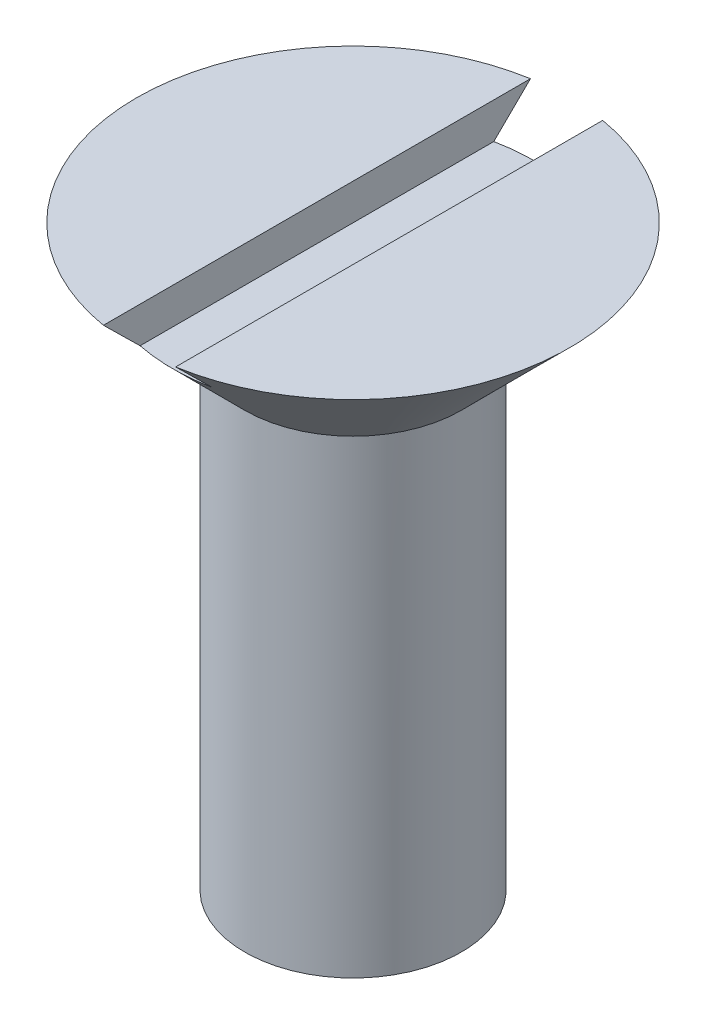
ISO-10303-21;
HEADER;
FILE_DESCRIPTION(('STEP AP214'),'2;1');
FILE_NAME('part.step','',(''),(''),'','','');
FILE_SCHEMA(('AUTOMOTIVE_DESIGN { 1 0 10303 214 1 1 1 1 }'));
ENDSEC;
DATA;
#1=APPLICATION_CONTEXT('core data for automotive mechanical design processes');
#2=APPLICATION_PROTOCOL_DEFINITION('international standard','automotive_design',2000,#1);
#3=PRODUCT_CONTEXT('',#1,'mechanical');
#4=PRODUCT('Part','Part','',(#3));
#5=PRODUCT_RELATED_PRODUCT_CATEGORY('part','',(#4));
#6=PRODUCT_DEFINITION_FORMATION('','',#4);
#7=PRODUCT_DEFINITION_CONTEXT('part definition',#1,'design');
#8=PRODUCT_DEFINITION('design','',#6,#7);
#9=PRODUCT_DEFINITION_SHAPE('','',#8);
#10=(LENGTH_UNIT() NAMED_UNIT(*) SI_UNIT(.MILLI.,.METRE.));
#11=(NAMED_UNIT(*) PLANE_ANGLE_UNIT() SI_UNIT($,.RADIAN.));
#12=(NAMED_UNIT(*) SI_UNIT($,.STERADIAN.) SOLID_ANGLE_UNIT());
#13=UNCERTAINTY_MEASURE_WITH_UNIT(LENGTH_MEASURE(1.E-05),#10,'distance_accuracy_value','');
#14=(GEOMETRIC_REPRESENTATION_CONTEXT(3) GLOBAL_UNCERTAINTY_ASSIGNED_CONTEXT((#13)) GLOBAL_UNIT_ASSIGNED_CONTEXT((#10,
#11,#12)) REPRESENTATION_CONTEXT('',''));
#15=CARTESIAN_POINT('',(0.,0.,0.));
#16=DIRECTION('',(0.,0.,1.));
#17=DIRECTION('',(1.,0.,0.));
#18=AXIS2_PLACEMENT_3D('',#15,#16,#17);
#19=CARTESIAN_POINT('',(0.,9.5,0.));
#20=DIRECTION('',(0.,-1.,0.));
#21=DIRECTION('',(1.,0.,0.));
#22=AXIS2_PLACEMENT_3D('',#19,#20,#21);
#23=PLANE('',#22);
#24=CARTESIAN_POINT('',(0.,9.49999999999999,0.));
#25=DIRECTION('',(0.,-1.,0.));
#26=DIRECTION('',(1.,0.,0.));
#27=AXIS2_PLACEMENT_3D('',#24,#25,#26);
#28=CIRCLE('',#27,5.99999999999999);
#29=CARTESIAN_POINT('',(1.,9.49999999999999,-5.9160797830996));
#30=VERTEX_POINT('',#29);
#31=CARTESIAN_POINT('',(1.,9.49999999999999,5.9160797830996));
#32=VERTEX_POINT('',#31);
#33=EDGE_CURVE('E92',#30,#32,#28,.T.);
#34=ORIENTED_EDGE('',*,*,#33,.F.);
#35=DIRECTION('',(0.,0.,1.));
#36=VECTOR('',#35,1.);
#37=CARTESIAN_POINT('',(1.,9.5,0.));
#38=LINE('',#37,#36);
#39=EDGE_CURVE('E79',#30,#32,#38,.T.);
#40=ORIENTED_EDGE('',*,*,#39,.T.);
#41=EDGE_LOOP('',(#34,#40));
#42=FACE_BOUND('',#41,.T.);
#43=ADVANCED_FACE('F33',(#42),#23,.F.);
#44=CARTESIAN_POINT('',(0.,6.5,0.));
#45=DIRECTION('',(0.,-1.,0.));
#46=DIRECTION('',(0.,0.,-1.));
#47=AXIS2_PLACEMENT_3D('',#44,#45,#46);
#48=CYLINDRICAL_SURFACE('',#47,3.);
#49=CARTESIAN_POINT('',(0.,6.5,0.));
#50=DIRECTION('',(0.,1.,0.));
#51=DIRECTION('',(0.,0.,1.));
#52=AXIS2_PLACEMENT_3D('',#49,#50,#51);
#53=CIRCLE('',#52,3.);
#54=CARTESIAN_POINT('',(0.,6.5,3.));
#55=VERTEX_POINT('',#54);
#56=EDGE_CURVE('E80',#55,#55,#53,.T.);
#57=ORIENTED_EDGE('',*,*,#56,.F.);
#58=EDGE_LOOP('',(#57));
#59=FACE_BOUND('',#58,.T.);
#60=CARTESIAN_POINT('',(0.,-6.5,0.));
#61=DIRECTION('',(0.,1.,0.));
#62=DIRECTION('',(-1.,0.,0.));
#63=AXIS2_PLACEMENT_3D('',#60,#61,#62);
#64=CIRCLE('',#63,3.);
#65=CARTESIAN_POINT('',(-3.,-6.5,0.));
#66=VERTEX_POINT('',#65);
#67=EDGE_CURVE('E91',#66,#66,#64,.T.);
#68=ORIENTED_EDGE('',*,*,#67,.T.);
#69=EDGE_LOOP('',(#68));
#70=FACE_BOUND('',#69,.T.);
#71=ADVANCED_FACE('F35',(#59,#70),#48,.T.);
#72=CARTESIAN_POINT('',(0.,-6.5,0.));
#73=DIRECTION('',(0.,1.,0.));
#74=DIRECTION('',(-1.,0.,0.));
#75=AXIS2_PLACEMENT_3D('',#72,#73,#74);
#76=CONICAL_SURFACE('',#75,3.,1.0471975511966);
#77=CARTESIAN_POINT('',(0.,-8.23205080756887,0.));
#78=VERTEX_POINT('',#77);
#79=VERTEX_LOOP('',#78);
#80=FACE_BOUND('',#79,.T.);
#81=ORIENTED_EDGE('',*,*,#67,.F.);
#82=EDGE_LOOP('',(#81));
#83=FACE_BOUND('',#82,.T.);
#84=ADVANCED_FACE('F136',(#80,#83),#76,.T.);
#85=CARTESIAN_POINT('',(0.,6.5,0.));
#86=DIRECTION('',(0.,1.,0.));
#87=DIRECTION('',(-1.,0.,0.));
#88=AXIS2_PLACEMENT_3D('',#85,#86,#87);
#89=CONICAL_SURFACE('',#88,3.,0.785398163397447);
#90=CARTESIAN_POINT('',(1.,16.7251567472754,-13.1872958179455));
#91=CARTESIAN_POINT('',(1.,16.2594414791178,-12.7202317663481));
#92=CARTESIAN_POINT('',(1.,15.7937860736166,-12.2531079656352));
#93=CARTESIAN_POINT('',(1.,14.8626599021035,-11.31864284358));
#94=CARTESIAN_POINT('',(1.,14.3971891433497,-10.851301515006));
#95=CARTESIAN_POINT('',(1.,13.4661229100358,-9.91592723198499));
#96=CARTESIAN_POINT('',(1.,13.0005276837378,-9.4478940303595));
#97=CARTESIAN_POINT('',(1.,12.0697931653922,-8.51140705834582));
#98=CARTESIAN_POINT('',(1.,11.6046538579373,-8.04295330327226));
#99=CARTESIAN_POINT('',(1.,10.6952303527664,-7.12564772780804));
#100=CARTESIAN_POINT('',(1.,10.2509157767302,-6.67682605040353));
#101=CARTESIAN_POINT('',(1.,9.58531249498371,-6.00268842358769));
#102=CARTESIAN_POINT('',(1.,9.3635777184798,-5.77781303550284));
#103=CARTESIAN_POINT('',(1.,8.92053573168434,-5.32764581841484));
#104=CARTESIAN_POINT('',(1.,8.69922851710114,-5.10235399363653));
#105=CARTESIAN_POINT('',(1.,8.25735053882471,-4.65128463421277));
#106=CARTESIAN_POINT('',(1.,8.03677944454956,-4.42550742379621));
#107=CARTESIAN_POINT('',(1.,7.59659022953599,-3.97300863145959));
#108=CARTESIAN_POINT('',(1.,7.37697214625638,-3.74628701309319));
#109=CARTESIAN_POINT('',(1.,6.93934912614002,-3.29136578605343));
#110=CARTESIAN_POINT('',(1.,6.7213438980336,-3.06316645892879));
#111=CARTESIAN_POINT('',(1.,6.3965872232529,-2.71875619816569));
#112=CARTESIAN_POINT('',(1.,6.28871351212862,-2.60360451292126));
#113=CARTESIAN_POINT('',(1.,6.07406788068338,-2.37227975690297));
#114=CARTESIAN_POINT('',(1.,5.96729593349165,-2.25610671116752));
#115=CARTESIAN_POINT('',(1.,5.8319548726192,-2.10670320150506));
#116=CARTESIAN_POINT('',(1.,5.80260827310486,-2.07417687156442));
#117=CARTESIAN_POINT('',(1.,5.74406556246667,-2.00898893052486));
#118=CARTESIAN_POINT('',(1.,5.71486945173175,-1.97632731907668));
#119=CARTESIAN_POINT('',(1.,5.62753158885472,-1.8781082916074));
#120=CARTESIAN_POINT('',(1.,5.56964574441201,-1.81232267136973));
#121=CARTESIAN_POINT('',(1.,5.4543788094703,-1.67949257125665));
#122=CARTESIAN_POINT('',(1.,5.39700416270754,-1.61244248408974));
#123=CARTESIAN_POINT('',(1.,5.28354317670074,-1.47728707035569));
#124=CARTESIAN_POINT('',(1.,5.22745650755542,-1.40918202166123));
#125=CARTESIAN_POINT('',(1.,5.11665514909253,-1.27094539813078));
#126=CARTESIAN_POINT('',(1.,5.06195522539418,-1.20080188785515));
#127=CARTESIAN_POINT('',(1.,4.9553572846224,-1.05844019622553));
#128=CARTESIAN_POINT('',(1.,4.90345837720404,-0.986222685440405));
#129=CARTESIAN_POINT('',(1.,4.80431328732326,-0.839161434732668));
#130=CARTESIAN_POINT('',(1.,4.75704257118705,-0.764334755914034));
#131=CARTESIAN_POINT('',(1.,4.69173119757185,-0.649006298438077));
#132=CARTESIAN_POINT('',(1.,4.67091066167954,-0.610087935057894));
#133=CARTESIAN_POINT('',(1.,4.63173292035239,-0.531037589401599));
#134=CARTESIAN_POINT('',(1.,4.61337431365398,-0.490906313559382));
#135=CARTESIAN_POINT('',(1.,4.58406393138009,-0.419490460771248));
#136=CARTESIAN_POINT('',(1.,4.57240699225112,-0.388496896961814));
#137=CARTESIAN_POINT('',(1.,4.55130538771347,-0.325753950605731));
#138=CARTESIAN_POINT('',(1.,4.54186081249004,-0.294004537305585));
#139=CARTESIAN_POINT('',(1.,4.52563562662322,-0.229962591669435));
#140=CARTESIAN_POINT('',(1.,4.51884411285098,-0.197672863306547));
#141=CARTESIAN_POINT('',(1.,4.508244068986,-0.132609587949217));
#142=CARTESIAN_POINT('',(1.,4.50443459648098,-0.0998361971449427));
#143=CARTESIAN_POINT('',(1.,4.50002125760406,-0.0337427660645101));
#144=CARTESIAN_POINT('',(1.,4.49944944402216,-0.00042052434033327));
#145=CARTESIAN_POINT('',(1.,4.50162894274971,0.066106977349594));
#146=CARTESIAN_POINT('',(1.,4.50438029208378,0.099312236007858));
#147=CARTESIAN_POINT('',(1.,4.51740606266353,0.198470520840597));
#148=CARTESIAN_POINT('',(1.,4.53246076156448,0.263822080253935));
#149=CARTESIAN_POINT('',(1.,4.56722440758747,0.375614330814849));
#150=CARTESIAN_POINT('',(1.,4.58487561562012,0.42275036495117));
#151=CARTESIAN_POINT('',(1.,4.62420074996022,0.51534258450047));
#152=CARTESIAN_POINT('',(1.,4.64587777118344,0.560797445023055));
#153=CARTESIAN_POINT('',(1.,4.69226708756991,0.65036787810982));
#154=CARTESIAN_POINT('',(1.,4.71699294492147,0.694476291774264));
#155=CARTESIAN_POINT('',(1.,4.768595456994,0.781379292681507));
#156=CARTESIAN_POINT('',(1.,4.79547120785551,0.82417442169449));
#157=CARTESIAN_POINT('',(1.,4.85614214091634,0.916828749418459));
#158=CARTESIAN_POINT('',(1.,4.89027471943994,0.966465584621188));
#159=CARTESIAN_POINT('',(1.,4.96018403830443,1.06457235885529));
#160=CARTESIAN_POINT('',(1.,4.99596110127485,1.11304206604225));
#161=CARTESIAN_POINT('',(1.,5.10513645907693,1.25715407688577));
#162=CARTESIAN_POINT('',(1.,5.18033188621512,1.35143029247925));
#163=CARTESIAN_POINT('',(1.,5.33367557538501,1.53790323878271));
#164=CARTESIAN_POINT('',(1.,5.41183065981283,1.63009427016475));
#165=CARTESIAN_POINT('',(1.,5.56989511079393,1.81288991740956));
#166=CARTESIAN_POINT('',(1.,5.64980374241727,1.90349517031247));
#167=CARTESIAN_POINT('',(1.,5.81098008322576,2.08380872041369));
#168=CARTESIAN_POINT('',(1.,5.89225018058457,2.17351487379724));
#169=CARTESIAN_POINT('',(1.,6.0556490990248,2.35215715158166));
#170=CARTESIAN_POINT('',(1.,6.1377780065437,2.44109319679344));
#171=CARTESIAN_POINT('',(1.,6.30252915009411,2.61824885183037));
#172=CARTESIAN_POINT('',(1.,6.38515042164193,2.70646935993894));
#173=CARTESIAN_POINT('',(1.,6.5508582679686,2.88246606317083));
#174=CARTESIAN_POINT('',(1.,6.63394482640426,2.97024227369646));
#175=CARTESIAN_POINT('',(1.,6.88218482628387,3.23142566754773));
#176=CARTESIAN_POINT('',(1.,7.04786039263831,3.40433638356982));
#177=CARTESIAN_POINT('',(1.,7.38009847617214,3.74930415511372));
#178=CARTESIAN_POINT('',(1.,7.54666100004192,3.92136120417731));
#179=CARTESIAN_POINT('',(1.,8.04724174917981,4.43668523196465));
#180=CARTESIAN_POINT('',(1.,8.38214272283872,4.77909420671125));
#181=CARTESIAN_POINT('',(1.,9.05334774862619,5.46294959353449));
#182=CARTESIAN_POINT('',(1.,9.38965254422716,5.80439527396645));
#183=CARTESIAN_POINT('',(1.,10.0629741512818,6.48657342741749));
#184=CARTESIAN_POINT('',(1.,10.3999909516379,6.82730591139039));
#185=CARTESIAN_POINT('',(1.,11.073661541335,7.50749846773098));
#186=CARTESIAN_POINT('',(1.,11.4103142367272,7.84695962424601));
#187=CARTESIAN_POINT('',(1.,12.0839276750187,8.52557885465702));
#188=CARTESIAN_POINT('',(1.,12.4208884191608,8.86473692731926));
#189=CARTESIAN_POINT('',(1.,13.4319813644562,9.88178552936563));
#190=CARTESIAN_POINT('',(1.,14.1064321918008,10.5593592642572));
#191=CARTESIAN_POINT('',(1.,14.9430035720262,11.3992334393841));
#192=CARTESIAN_POINT('',(1.,15.1049073655753,11.5617499364057));
#193=CARTESIAN_POINT('',(1.,15.4287437938772,11.8867625301678));
#194=CARTESIAN_POINT('',(1.,15.5906764292649,12.0492586262759));
#195=CARTESIAN_POINT('',(1.,15.9146913666169,12.3743580356593));
#196=CARTESIAN_POINT('',(1.,16.0767736855866,12.5369613319847));
#197=CARTESIAN_POINT('',(1.,16.4009534139574,12.8621445215465));
#198=CARTESIAN_POINT('',(1.,16.5630508228615,13.0247244152783));
#199=CARTESIAN_POINT('',(1.,16.7251567472754,13.1872958179455));
#200=B_SPLINE_CURVE_WITH_KNOTS('',3,(#90,#91,#92,#93,#94,#95,#96,#97,#98,#99,#100,#101,#102,
#103,#104,#105,#106,#107,#108,#109,#110,#111,#112,#113,#114,#115,#116,#117,#118,#119,#120,#121,
#122,#123,#124,#125,#126,#127,#128,#129,#130,#131,#132,#133,#134,#135,#136,#137,#138,#139,#140,
#141,#142,#143,#144,#145,#146,#147,#148,#149,#150,#151,#152,#153,#154,#155,#156,#157,#158,#159,
#160,#161,#162,#163,#164,#165,#166,#167,#168,#169,#170,#171,#172,#173,#174,#175,#176,#177,#178,
#179,#180,#181,#182,#183,#184,#185,#186,#187,#188,#189,#190,#191,#192,#193,#194,#195,#196,#197,
#198,#199),.UNSPECIFIED.,.F.,.F.,(4,2,2,2,2,2,2,2,2,2,2,2,2,2,2,2,2,2,2,2,2,2,2,2,2,2,2,2,2,2,2,
2,2,2,2,2,2,2,2,2,2,2,2,2,2,2,2,2,2,2,2,2,2,2,4),(0.,1.97872587118028,3.95752304535767,
5.93805456774883,7.91851667815787,9.81316743215694,10.7605936759815,11.708010360122,
12.6549203197725,13.6018671672758,14.5486386107719,15.021994896276,15.4953396097406,
15.6267647179145,15.7581901655778,16.0210653289042,16.2857953835388,16.5504568566002,
16.8172589227084,17.0839756761738,17.3491918719428,17.4815437637396,17.6138200017567,
17.7130923415352,17.8123687273669,17.9112327193647,18.0100654548209,18.1098749451448,
18.2096855474941,18.4097318562945,18.5605378545615,18.7114602711747,18.863080050805,
19.0146364180388,19.1953088303077,19.3760168410567,19.737682988617,20.1002407220098,
20.4626493010368,20.8257790924516,21.188945790819,21.551548362588,21.9141382768624,
22.6325463210147,23.3509597918652,24.7878319559268,26.2255983285277,27.6633424543506,
29.0976086793586,30.5318807164326,33.3999650230749,34.0881656179444,34.7763839195799,
35.4651470059799,36.1538923322193),.UNSPECIFIED.);
#201=CARTESIAN_POINT('',(1.,8.49999999999999,4.89897948556634));
#202=VERTEX_POINT('',#201);
#203=EDGE_CURVE('E88',#202,#32,#200,.T.);
#204=ORIENTED_EDGE('',*,*,#203,.F.);
#205=CARTESIAN_POINT('',(0.,8.49999999999999,0.));
#206=DIRECTION('',(0.,-1.,0.));
#207=DIRECTION('',(0.,0.,-1.));
#208=AXIS2_PLACEMENT_3D('',#205,#206,#207);
#209=CIRCLE('',#208,4.99999999999999);
#210=CARTESIAN_POINT('',(-1.,8.49999999999999,4.89897948556635));
#211=VERTEX_POINT('',#210);
#212=EDGE_CURVE('E11',#211,#202,#209,.F.);
#213=ORIENTED_EDGE('',*,*,#212,.F.);
#214=CARTESIAN_POINT('',(-1.,16.7251567472754,13.1872958179455));
#215=CARTESIAN_POINT('',(-1.,16.2594414791178,12.7202317663481));
#216=CARTESIAN_POINT('',(-1.,15.7937860736166,12.2531079656352));
#217=CARTESIAN_POINT('',(-1.,14.8626599021035,11.31864284358));
#218=CARTESIAN_POINT('',(-1.,14.3971891433497,10.851301515006));
#219=CARTESIAN_POINT('',(-1.,13.4661229100358,9.91592723198498));
#220=CARTESIAN_POINT('',(-1.,13.0005276837378,9.44789403035949));
#221=CARTESIAN_POINT('',(-1.,12.0697931653922,8.51140705834581));
#222=CARTESIAN_POINT('',(-1.,11.6046538579373,8.04295330327224));
#223=CARTESIAN_POINT('',(-1.,10.6952303527664,7.12564772780802));
#224=CARTESIAN_POINT('',(-1.,10.2509157767302,6.67682605040351));
#225=CARTESIAN_POINT('',(-1.,9.5853124949837,6.00268842358768));
#226=CARTESIAN_POINT('',(-1.,9.36357771847979,5.77781303550283));
#227=CARTESIAN_POINT('',(-1.,8.92053573168433,5.32764581841483));
#228=CARTESIAN_POINT('',(-1.,8.69922851710113,5.10235399363652));
#229=CARTESIAN_POINT('',(-1.,8.2573505388247,4.65128463421276));
#230=CARTESIAN_POINT('',(-1.,8.03677944454955,4.4255074237962));
#231=CARTESIAN_POINT('',(-1.,7.59659022953598,3.97300863145958));
#232=CARTESIAN_POINT('',(-1.,7.37697214625637,3.74628701309318));
#233=CARTESIAN_POINT('',(-1.,6.93934912614001,3.29136578605342));
#234=CARTESIAN_POINT('',(-1.,6.7213438980336,3.06316645892878));
#235=CARTESIAN_POINT('',(-1.,6.3965872232529,2.71875619816568));
#236=CARTESIAN_POINT('',(-1.,6.28871351212862,2.60360451292126));
#237=CARTESIAN_POINT('',(-1.,6.07406788068338,2.37227975690297));
#238=CARTESIAN_POINT('',(-1.,5.96729593349164,2.25610671116752));
#239=CARTESIAN_POINT('',(-1.,5.8319548726192,2.10670320150506));
#240=CARTESIAN_POINT('',(-1.,5.80260827310487,2.07417687156443));
#241=CARTESIAN_POINT('',(-1.,5.74406556246668,2.00898893052486));
#242=CARTESIAN_POINT('',(-1.,5.71486945173176,1.97632731907669));
#243=CARTESIAN_POINT('',(-1.,5.62753158885472,1.8781082916074));
#244=CARTESIAN_POINT('',(-1.,5.56964574441201,1.81232267136974));
#245=CARTESIAN_POINT('',(-1.,5.4543788094703,1.67949257125665));
#246=CARTESIAN_POINT('',(-1.,5.39700416270754,1.61244248408974));
#247=CARTESIAN_POINT('',(-1.,5.28354317670074,1.47728707035569));
#248=CARTESIAN_POINT('',(-1.,5.22745650755542,1.40918202166123));
#249=CARTESIAN_POINT('',(-1.,5.11665514909253,1.27094539813078));
#250=CARTESIAN_POINT('',(-1.,5.06195522539418,1.20080188785515));
#251=CARTESIAN_POINT('',(-1.,4.9553572846224,1.05844019622553));
#252=CARTESIAN_POINT('',(-1.,4.90345837720404,0.986222685440405));
#253=CARTESIAN_POINT('',(-1.,4.80431328732326,0.839161434732667));
#254=CARTESIAN_POINT('',(-1.,4.75704257118705,0.764334755914033));
#255=CARTESIAN_POINT('',(-1.,4.69173119757185,0.649006298438075));
#256=CARTESIAN_POINT('',(-1.,4.67091066167954,0.610087935057892));
#257=CARTESIAN_POINT('',(-1.,4.63173292035239,0.531037589401597));
#258=CARTESIAN_POINT('',(-1.,4.61337431365398,0.490906313559381));
#259=CARTESIAN_POINT('',(-1.,4.58406393138009,0.419490460771247));
#260=CARTESIAN_POINT('',(-1.,4.57240699225112,0.388496896961812));
#261=CARTESIAN_POINT('',(-1.,4.55130538771347,0.32575395060573));
#262=CARTESIAN_POINT('',(-1.,4.54186081249004,0.294004537305584));
#263=CARTESIAN_POINT('',(-1.,4.52563562662322,0.229962591669434));
#264=CARTESIAN_POINT('',(-1.,4.51884411285099,0.197672863306546));
#265=CARTESIAN_POINT('',(-1.,4.508244068986,0.132609587949216));
#266=CARTESIAN_POINT('',(-1.,4.50443459648098,0.0998361971449411));
#267=CARTESIAN_POINT('',(-1.,4.50002125760407,0.0337427660645097));
#268=CARTESIAN_POINT('',(-1.,4.49944944402216,0.000420524340334226));
#269=CARTESIAN_POINT('',(-1.,4.50162894274971,-0.0661069773495925));
#270=CARTESIAN_POINT('',(-1.,4.50438029208378,-0.0993122360078575));
#271=CARTESIAN_POINT('',(-1.,4.51740606266353,-0.198470520840598));
#272=CARTESIAN_POINT('',(-1.,4.53246076156448,-0.263822080253937));
#273=CARTESIAN_POINT('',(-1.,4.56722440758747,-0.375614330814851));
#274=CARTESIAN_POINT('',(-1.,4.58487561562012,-0.422750364951172));
#275=CARTESIAN_POINT('',(-1.,4.62420074996023,-0.515342584500472));
#276=CARTESIAN_POINT('',(-1.,4.64587777118344,-0.560797445023057));
#277=CARTESIAN_POINT('',(-1.,4.69226708756991,-0.650367878109822));
#278=CARTESIAN_POINT('',(-1.,4.71699294492147,-0.694476291774266));
#279=CARTESIAN_POINT('',(-1.,4.76859545699401,-0.78137929268151));
#280=CARTESIAN_POINT('',(-1.,4.79547120785552,-0.824174421694494));
#281=CARTESIAN_POINT('',(-1.,4.85614214091635,-0.916828749418464));
#282=CARTESIAN_POINT('',(-1.,4.89027471943994,-0.966465584621194));
#283=CARTESIAN_POINT('',(-1.,4.96018403830444,-1.06457235885529));
#284=CARTESIAN_POINT('',(-1.,4.99596110127486,-1.11304206604226));
#285=CARTESIAN_POINT('',(-1.,5.10513645907693,-1.25715407688577));
#286=CARTESIAN_POINT('',(-1.,5.18033188621513,-1.35143029247925));
#287=CARTESIAN_POINT('',(-1.,5.33367557538502,-1.53790323878272));
#288=CARTESIAN_POINT('',(-1.,5.41183065981284,-1.63009427016476));
#289=CARTESIAN_POINT('',(-1.,5.56989511079394,-1.81288991740957));
#290=CARTESIAN_POINT('',(-1.,5.64980374241728,-1.90349517031248));
#291=CARTESIAN_POINT('',(-1.,5.81098008322577,-2.0838087204137));
#292=CARTESIAN_POINT('',(-1.,5.89225018058458,-2.17351487379725));
#293=CARTESIAN_POINT('',(-1.,6.05564909902481,-2.35215715158168));
#294=CARTESIAN_POINT('',(-1.,6.13777800654371,-2.44109319679345));
#295=CARTESIAN_POINT('',(-1.,6.30252915009412,-2.61824885183039));
#296=CARTESIAN_POINT('',(-1.,6.38515042164195,-2.70646935993895));
#297=CARTESIAN_POINT('',(-1.,6.55085826796861,-2.88246606317085));
#298=CARTESIAN_POINT('',(-1.,6.63394482640427,-2.97024227369647));
#299=CARTESIAN_POINT('',(-1.,6.88218482628389,-3.23142566754775));
#300=CARTESIAN_POINT('',(-1.,7.04786039263833,-3.40433638356984));
#301=CARTESIAN_POINT('',(-1.,7.38009847617216,-3.74930415511374));
#302=CARTESIAN_POINT('',(-1.,7.54666100004194,-3.92136120417733));
#303=CARTESIAN_POINT('',(-1.,8.04724174917983,-4.43668523196468));
#304=CARTESIAN_POINT('',(-1.,8.38214272283874,-4.77909420671128));
#305=CARTESIAN_POINT('',(-1.,9.05334774862622,-5.46294959353452));
#306=CARTESIAN_POINT('',(-1.,9.38965254422719,-5.80439527396648));
#307=CARTESIAN_POINT('',(-1.,10.0629741512819,-6.48657342741753));
#308=CARTESIAN_POINT('',(-1.,10.399990951638,-6.82730591139044));
#309=CARTESIAN_POINT('',(-1.,11.073661541335,-7.50749846773103));
#310=CARTESIAN_POINT('',(-1.,11.4103142367273,-7.84695962424605));
#311=CARTESIAN_POINT('',(-1.,12.0839276750188,-8.52557885465707));
#312=CARTESIAN_POINT('',(-1.,12.4208884191608,-8.86473692731931));
#313=CARTESIAN_POINT('',(-1.,13.4319813644563,-9.88178552936568));
#314=CARTESIAN_POINT('',(-1.,14.1064321918009,-10.5593592642573));
#315=CARTESIAN_POINT('',(-1.,14.9430035720263,-11.3992334393841));
#316=CARTESIAN_POINT('',(-1.,15.1049073655754,-11.5617499364057));
#317=CARTESIAN_POINT('',(-1.,15.4287437938773,-11.8867625301679));
#318=CARTESIAN_POINT('',(-1.,15.590676429265,-12.0492586262759));
#319=CARTESIAN_POINT('',(-1.,15.9146913666169,-12.3743580356593));
#320=CARTESIAN_POINT('',(-1.,16.0767736855867,-12.5369613319847));
#321=CARTESIAN_POINT('',(-1.,16.4009534139574,-12.8621445215465));
#322=CARTESIAN_POINT('',(-1.,16.5630508228615,-13.0247244152783));
#323=CARTESIAN_POINT('',(-1.,16.7251567472754,-13.1872958179455));
#324=B_SPLINE_CURVE_WITH_KNOTS('',3,(#214,#215,#216,#217,#218,#219,#220,#221,#222,#223,#224,
#225,#226,#227,#228,#229,#230,#231,#232,#233,#234,#235,#236,#237,#238,#239,#240,#241,#242,#243,
#244,#245,#246,#247,#248,#249,#250,#251,#252,#253,#254,#255,#256,#257,#258,#259,#260,#261,#262,
#263,#264,#265,#266,#267,#268,#269,#270,#271,#272,#273,#274,#275,#276,#277,#278,#279,#280,#281,
#282,#283,#284,#285,#286,#287,#288,#289,#290,#291,#292,#293,#294,#295,#296,#297,#298,#299,#300,
#301,#302,#303,#304,#305,#306,#307,#308,#309,#310,#311,#312,#313,#314,#315,#316,#317,#318,#319,
#320,#321,#322,#323),.UNSPECIFIED.,.F.,.F.,(4,2,2,2,2,2,2,2,2,2,2,2,2,2,2,2,2,2,2,2,2,2,2,2,2,2,
2,2,2,2,2,2,2,2,2,2,2,2,2,2,2,2,2,2,2,2,2,2,2,2,2,2,2,2,4),(0.,1.97872587118029,
3.95752304535768,5.93805456774885,7.9185166781579,9.81316743215697,10.7605936759815,
11.708010360122,12.6549203197725,13.6018671672758,14.5486386107719,15.0219948962759,
15.4953396097406,15.6267647179145,15.7581901655778,16.0210653289042,16.2857953835388,
16.5504568566002,16.8172589227083,17.0839756761738,17.3491918719428,17.4815437637396,
17.6138200017566,17.7130923415352,17.8123687273669,17.9112327193647,18.0100654548209,
18.1098749451448,18.2096855474941,18.4097318562945,18.5605378545614,18.7114602711746,
18.863080050805,19.0146364180388,19.1953088303077,19.3760168410567,19.737682988617,
20.1002407220099,20.4626493010368,20.8257790924516,21.188945790819,21.551548362588,
21.9141382768624,22.6325463210147,23.3509597918653,24.7878319559268,26.2255983285278,
27.6633424543507,29.0976086793587,30.5318807164327,33.399965023075,34.0881656179445,
34.77638391958,35.46514700598,36.1538923322193),.UNSPECIFIED.);
#325=CARTESIAN_POINT('',(-1.,9.49999999999999,5.9160797830996));
#326=VERTEX_POINT('',#325);
#327=EDGE_CURVE('E74',#326,#211,#324,.T.);
#328=ORIENTED_EDGE('',*,*,#327,.F.);
#329=CARTESIAN_POINT('',(-1.,9.49999999999999,-5.9160797830996));
#330=VERTEX_POINT('',#329);
#331=EDGE_CURVE('E87',#326,#330,#28,.T.);
#332=ORIENTED_EDGE('',*,*,#331,.T.);
#333=CARTESIAN_POINT('',(-1.,8.49999999999999,-4.89897948556635));
#334=VERTEX_POINT('',#333);
#335=EDGE_CURVE('E48',#334,#330,#324,.T.);
#336=ORIENTED_EDGE('',*,*,#335,.F.);
#337=CARTESIAN_POINT('',(1.,8.49999999999999,-4.89897948556635));
#338=VERTEX_POINT('',#337);
#339=EDGE_CURVE('E37',#338,#334,#209,.F.);
#340=ORIENTED_EDGE('',*,*,#339,.F.);
#341=EDGE_CURVE('E97',#30,#338,#200,.T.);
#342=ORIENTED_EDGE('',*,*,#341,.F.);
#343=ORIENTED_EDGE('',*,*,#33,.T.);
#344=EDGE_LOOP('',(#204,#213,#328,#332,#336,#340,#342,#343));
#345=FACE_BOUND('',#344,.T.);
#346=ORIENTED_EDGE('',*,*,#56,.T.);
#347=EDGE_LOOP('',(#346));
#348=FACE_BOUND('',#347,.T.);
#349=ADVANCED_FACE('F85',(#345,#348),#89,.T.);
#350=ORIENTED_EDGE('',*,*,#331,.F.);
#351=DIRECTION('',(0.,0.,-1.));
#352=VECTOR('',#351,1.);
#353=CARTESIAN_POINT('',(-1.,9.5,0.));
#354=LINE('',#353,#352);
#355=EDGE_CURVE('E71',#326,#330,#354,.T.);
#356=ORIENTED_EDGE('',*,*,#355,.T.);
#357=EDGE_LOOP('',(#350,#356));
#358=FACE_BOUND('',#357,.T.);
#359=ADVANCED_FACE('F90',(#358),#23,.F.);
#360=CARTESIAN_POINT('',(1.,8.49999999999999,-7.));
#361=DIRECTION('',(1.,0.,0.));
#362=DIRECTION('',(0.,0.,-1.));
#363=AXIS2_PLACEMENT_3D('',#360,#361,#362);
#364=PLANE('',#363);
#365=ORIENTED_EDGE('',*,*,#341,.T.);
#366=DIRECTION('',(0.,0.,1.));
#367=VECTOR('',#366,1.);
#368=CARTESIAN_POINT('',(1.,8.49999999999999,-7.));
#369=LINE('',#368,#367);
#370=EDGE_CURVE('E115',#338,#202,#369,.T.);
#371=ORIENTED_EDGE('',*,*,#370,.T.);
#372=ORIENTED_EDGE('',*,*,#203,.T.);
#373=ORIENTED_EDGE('',*,*,#39,.F.);
#374=EDGE_LOOP('',(#365,#371,#372,#373));
#375=FACE_BOUND('',#374,.T.);
#376=ADVANCED_FACE('F128',(#375),#364,.F.);
#377=CARTESIAN_POINT('',(-1.,8.49999999999999,-7.));
#378=DIRECTION('',(0.,-1.,0.));
#379=DIRECTION('',(0.,0.,-1.));
#380=AXIS2_PLACEMENT_3D('',#377,#378,#379);
#381=PLANE('',#380);
#382=ORIENTED_EDGE('',*,*,#212,.T.);
#383=ORIENTED_EDGE('',*,*,#370,.F.);
#384=ORIENTED_EDGE('',*,*,#339,.T.);
#385=DIRECTION('',(0.,0.,1.));
#386=VECTOR('',#385,1.);
#387=CARTESIAN_POINT('',(-1.,8.49999999999999,-7.));
#388=LINE('',#387,#386);
#389=EDGE_CURVE('E113',#334,#211,#388,.T.);
#390=ORIENTED_EDGE('',*,*,#389,.T.);
#391=EDGE_LOOP('',(#382,#383,#384,#390));
#392=FACE_BOUND('',#391,.T.);
#393=ADVANCED_FACE('F112',(#392),#381,.F.);
#394=CARTESIAN_POINT('',(-1.,9.49999999999999,-7.));
#395=DIRECTION('',(-1.,0.,0.));
#396=DIRECTION('',(0.,0.,1.));
#397=AXIS2_PLACEMENT_3D('',#394,#395,#396);
#398=PLANE('',#397);
#399=ORIENTED_EDGE('',*,*,#327,.T.);
#400=ORIENTED_EDGE('',*,*,#389,.F.);
#401=ORIENTED_EDGE('',*,*,#335,.T.);
#402=ORIENTED_EDGE('',*,*,#355,.F.);
#403=EDGE_LOOP('',(#399,#400,#401,#402));
#404=FACE_BOUND('',#403,.T.);
#405=ADVANCED_FACE('F73',(#404),#398,.F.);
#406=CLOSED_SHELL('',(#43,#71,#84,#349,#359,#376,#393,#405));
#407=MANIFOLD_SOLID_BREP('B2',#406);
#408=ADVANCED_BREP_SHAPE_REPRESENTATION('',(#18,#407),#14);
#409=SHAPE_DEFINITION_REPRESENTATION(#9,#408);
ENDSEC;
END-ISO-10303-21;
